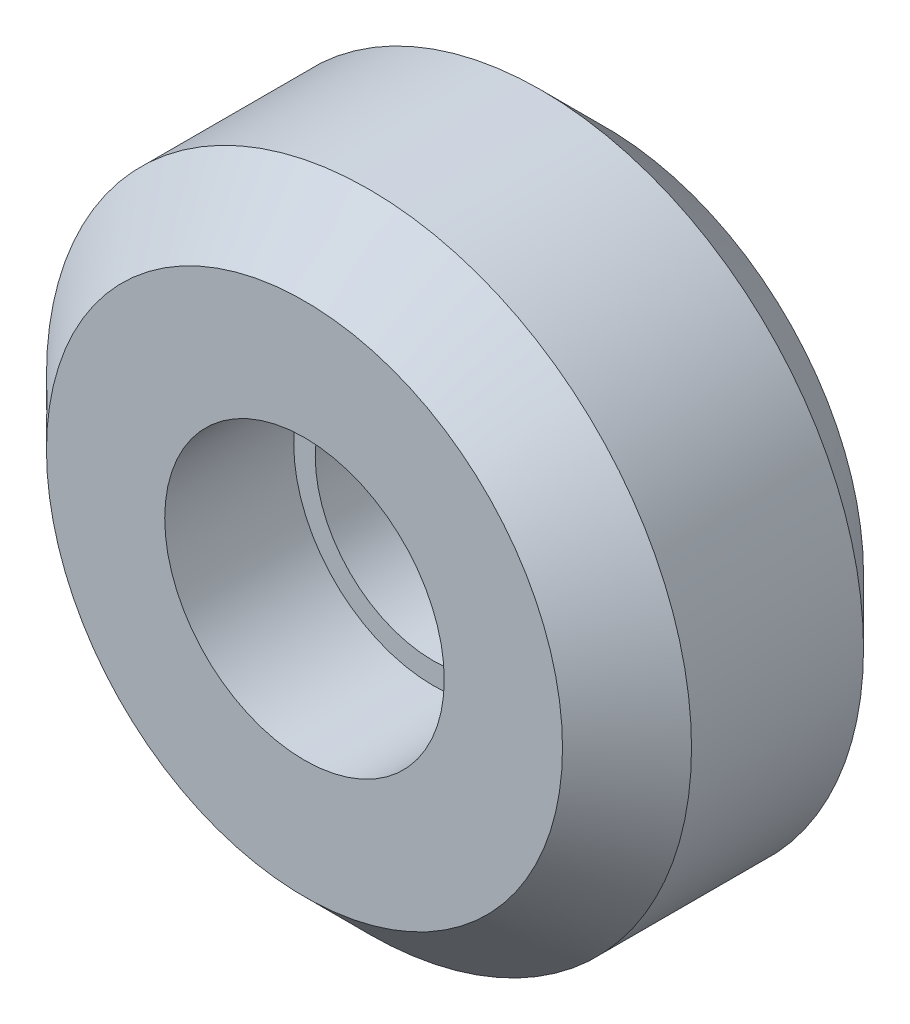
ISO-10303-21;
HEADER;
FILE_DESCRIPTION(('STEP AP214'),'2;1');
FILE_NAME('part.step','',(''),(''),'','','');
FILE_SCHEMA(('AUTOMOTIVE_DESIGN { 1 0 10303 214 1 1 1 1 }'));
ENDSEC;
DATA;
#1=APPLICATION_CONTEXT('core data for automotive mechanical design processes');
#2=APPLICATION_PROTOCOL_DEFINITION('international standard','automotive_design',2000,#1);
#3=PRODUCT_CONTEXT('',#1,'mechanical');
#4=PRODUCT('Part','Part','',(#3));
#5=PRODUCT_RELATED_PRODUCT_CATEGORY('part','',(#4));
#6=PRODUCT_DEFINITION_FORMATION('','',#4);
#7=PRODUCT_DEFINITION_CONTEXT('part definition',#1,'design');
#8=PRODUCT_DEFINITION('design','',#6,#7);
#9=PRODUCT_DEFINITION_SHAPE('','',#8);
#10=(LENGTH_UNIT() NAMED_UNIT(*) SI_UNIT(.MILLI.,.METRE.));
#11=(NAMED_UNIT(*) PLANE_ANGLE_UNIT() SI_UNIT($,.RADIAN.));
#12=(NAMED_UNIT(*) SI_UNIT($,.STERADIAN.) SOLID_ANGLE_UNIT());
#13=UNCERTAINTY_MEASURE_WITH_UNIT(LENGTH_MEASURE(1.E-05),#10,'distance_accuracy_value','');
#14=(GEOMETRIC_REPRESENTATION_CONTEXT(3) GLOBAL_UNCERTAINTY_ASSIGNED_CONTEXT((#13)) GLOBAL_UNIT_ASSIGNED_CONTEXT((#10,
#11,#12)) REPRESENTATION_CONTEXT('',''));
#15=CARTESIAN_POINT('',(0.,0.,0.));
#16=DIRECTION('',(0.,0.,1.));
#17=DIRECTION('',(1.,0.,0.));
#18=AXIS2_PLACEMENT_3D('',#15,#16,#17);
#19=CARTESIAN_POINT('',(0.,0.,8.));
#20=DIRECTION('',(0.,0.,1.));
#21=DIRECTION('',(1.,0.,0.));
#22=AXIS2_PLACEMENT_3D('',#19,#20,#21);
#23=PLANE('',#22);
#24=CARTESIAN_POINT('',(0.,0.,8.));
#25=DIRECTION('',(0.,0.,1.));
#26=DIRECTION('',(1.,0.,0.));
#27=AXIS2_PLACEMENT_3D('',#24,#25,#26);
#28=CIRCLE('',#27,5.5);
#29=CARTESIAN_POINT('',(5.5,0.,8.));
#30=VERTEX_POINT('',#29);
#31=EDGE_CURVE('E56',#30,#30,#28,.T.);
#32=ORIENTED_EDGE('',*,*,#31,.F.);
#33=EDGE_LOOP('',(#32));
#34=FACE_BOUND('',#33,.T.);
#35=CARTESIAN_POINT('',(0.,0.,8.));
#36=DIRECTION('',(0.,0.,1.));
#37=DIRECTION('',(1.,0.,0.));
#38=AXIS2_PLACEMENT_3D('',#35,#36,#37);
#39=CIRCLE('',#38,6.5);
#40=CARTESIAN_POINT('',(6.5,0.,8.));
#41=VERTEX_POINT('',#40);
#42=EDGE_CURVE('E53',#41,#41,#39,.F.);
#43=ORIENTED_EDGE('',*,*,#42,.F.);
#44=EDGE_LOOP('',(#43));
#45=FACE_BOUND('',#44,.T.);
#46=ADVANCED_FACE('F33',(#34,#45),#23,.T.);
#47=CARTESIAN_POINT('',(0.,0.,0.));
#48=DIRECTION('',(0.,0.,1.));
#49=DIRECTION('',(1.,0.,0.));
#50=AXIS2_PLACEMENT_3D('',#47,#48,#49);
#51=PLANE('',#50);
#52=CARTESIAN_POINT('',(0.,0.,0.));
#53=DIRECTION('',(0.,0.,1.));
#54=DIRECTION('',(1.,0.,0.));
#55=AXIS2_PLACEMENT_3D('',#52,#53,#54);
#56=CIRCLE('',#55,12.);
#57=CARTESIAN_POINT('',(12.,0.,0.));
#58=VERTEX_POINT('',#57);
#59=EDGE_CURVE('E10',#58,#58,#56,.F.);
#60=ORIENTED_EDGE('',*,*,#59,.T.);
#61=EDGE_LOOP('',(#60));
#62=FACE_BOUND('',#61,.T.);
#63=CARTESIAN_POINT('',(0.,0.,0.));
#64=DIRECTION('',(0.,0.,1.));
#65=DIRECTION('',(1.,0.,0.));
#66=AXIS2_PLACEMENT_3D('',#63,#64,#65);
#67=CIRCLE('',#66,5.5);
#68=CARTESIAN_POINT('',(5.5,0.,0.));
#69=VERTEX_POINT('',#68);
#70=EDGE_CURVE('E57',#69,#69,#67,.T.);
#71=ORIENTED_EDGE('',*,*,#70,.T.);
#72=EDGE_LOOP('',(#71));
#73=FACE_BOUND('',#72,.T.);
#74=ADVANCED_FACE('F84',(#62,#73),#51,.F.);
#75=CARTESIAN_POINT('',(0.,0.,8.));
#76=DIRECTION('',(0.,0.,-1.));
#77=DIRECTION('',(-1.,0.,0.));
#78=AXIS2_PLACEMENT_3D('',#75,#76,#77);
#79=CYLINDRICAL_SURFACE('',#78,15.);
#80=CARTESIAN_POINT('',(0.,0.,11.));
#81=DIRECTION('',(0.,0.,1.));
#82=DIRECTION('',(1.,0.,0.));
#83=AXIS2_PLACEMENT_3D('',#80,#81,#82);
#84=CIRCLE('',#83,15.);
#85=CARTESIAN_POINT('',(15.,0.,11.));
#86=VERTEX_POINT('',#85);
#87=EDGE_CURVE('E40',#86,#86,#84,.F.);
#88=ORIENTED_EDGE('',*,*,#87,.T.);
#89=EDGE_LOOP('',(#88));
#90=FACE_BOUND('',#89,.T.);
#91=CARTESIAN_POINT('',(0.,0.,3.00000000000001));
#92=DIRECTION('',(0.,0.,1.));
#93=DIRECTION('',(1.,0.,0.));
#94=AXIS2_PLACEMENT_3D('',#91,#92,#93);
#95=CIRCLE('',#94,15.);
#96=CARTESIAN_POINT('',(15.,0.,3.00000000000001));
#97=VERTEX_POINT('',#96);
#98=EDGE_CURVE('E44',#97,#97,#95,.T.);
#99=ORIENTED_EDGE('',*,*,#98,.T.);
#100=EDGE_LOOP('',(#99));
#101=FACE_BOUND('',#100,.T.);
#102=ADVANCED_FACE('F80',(#90,#101),#79,.T.);
#103=CARTESIAN_POINT('',(0.,0.,8.));
#104=DIRECTION('',(0.,0.,-1.));
#105=DIRECTION('',(-1.,0.,0.));
#106=AXIS2_PLACEMENT_3D('',#103,#104,#105);
#107=CYLINDRICAL_SURFACE('',#106,5.5);
#108=ORIENTED_EDGE('',*,*,#31,.T.);
#109=EDGE_LOOP('',(#108));
#110=FACE_BOUND('',#109,.T.);
#111=ORIENTED_EDGE('',*,*,#70,.F.);
#112=EDGE_LOOP('',(#111));
#113=FACE_BOUND('',#112,.T.);
#114=ADVANCED_FACE('F71',(#110,#113),#107,.F.);
#115=CARTESIAN_POINT('',(0.,0.,14.));
#116=DIRECTION('',(0.,0.,1.));
#117=DIRECTION('',(1.,0.,0.));
#118=AXIS2_PLACEMENT_3D('',#115,#116,#117);
#119=PLANE('',#118);
#120=CARTESIAN_POINT('',(0.,0.,14.));
#121=DIRECTION('',(0.,0.,1.));
#122=DIRECTION('',(1.,0.,0.));
#123=AXIS2_PLACEMENT_3D('',#120,#121,#122);
#124=CIRCLE('',#123,12.);
#125=CARTESIAN_POINT('',(12.,0.,14.));
#126=VERTEX_POINT('',#125);
#127=EDGE_CURVE('E48',#126,#126,#124,.T.);
#128=ORIENTED_EDGE('',*,*,#127,.T.);
#129=EDGE_LOOP('',(#128));
#130=FACE_BOUND('',#129,.T.);
#131=CARTESIAN_POINT('',(0.,0.,14.));
#132=DIRECTION('',(0.,0.,1.));
#133=DIRECTION('',(1.,0.,0.));
#134=AXIS2_PLACEMENT_3D('',#131,#132,#133);
#135=CIRCLE('',#134,6.5);
#136=CARTESIAN_POINT('',(6.5,0.,14.));
#137=VERTEX_POINT('',#136);
#138=EDGE_CURVE('E60',#137,#137,#135,.T.);
#139=ORIENTED_EDGE('',*,*,#138,.F.);
#140=EDGE_LOOP('',(#139));
#141=FACE_BOUND('',#140,.T.);
#142=ADVANCED_FACE('F69',(#130,#141),#119,.T.);
#143=CARTESIAN_POINT('',(0.,0.,14.));
#144=DIRECTION('',(0.,0.,-1.));
#145=DIRECTION('',(-1.,0.,0.));
#146=AXIS2_PLACEMENT_3D('',#143,#144,#145);
#147=CYLINDRICAL_SURFACE('',#146,6.5);
#148=ORIENTED_EDGE('',*,*,#138,.T.);
#149=EDGE_LOOP('',(#148));
#150=FACE_BOUND('',#149,.T.);
#151=ORIENTED_EDGE('',*,*,#42,.T.);
#152=EDGE_LOOP('',(#151));
#153=FACE_BOUND('',#152,.T.);
#154=ADVANCED_FACE('F66',(#150,#153),#147,.F.);
#155=CARTESIAN_POINT('',(0.,0.,14.));
#156=DIRECTION('',(0.,0.,-1.));
#157=DIRECTION('',(-1.,0.,0.));
#158=AXIS2_PLACEMENT_3D('',#155,#156,#157);
#159=CONICAL_SURFACE('',#158,12.,0.785398163397447);
#160=ORIENTED_EDGE('',*,*,#87,.F.);
#161=EDGE_LOOP('',(#160));
#162=FACE_BOUND('',#161,.T.);
#163=ORIENTED_EDGE('',*,*,#127,.F.);
#164=EDGE_LOOP('',(#163));
#165=FACE_BOUND('',#164,.T.);
#166=ADVANCED_FACE('F78',(#162,#165),#159,.T.);
#167=CARTESIAN_POINT('',(0.,0.,3.00000000000001));
#168=DIRECTION('',(0.,0.,1.));
#169=DIRECTION('',(1.,0.,0.));
#170=AXIS2_PLACEMENT_3D('',#167,#168,#169);
#171=CONICAL_SURFACE('',#170,15.,0.78539816339745);
#172=ORIENTED_EDGE('',*,*,#59,.F.);
#173=EDGE_LOOP('',(#172));
#174=FACE_BOUND('',#173,.T.);
#175=ORIENTED_EDGE('',*,*,#98,.F.);
#176=EDGE_LOOP('',(#175));
#177=FACE_BOUND('',#176,.T.);
#178=ADVANCED_FACE('F35',(#174,#177),#171,.T.);
#179=CLOSED_SHELL('',(#46,#74,#102,#114,#142,#154,#166,#178));
#180=MANIFOLD_SOLID_BREP('B2',#179);
#181=ADVANCED_BREP_SHAPE_REPRESENTATION('',(#18,#180),#14);
#182=SHAPE_DEFINITION_REPRESENTATION(#9,#181);
ENDSEC;
END-ISO-10303-21;
